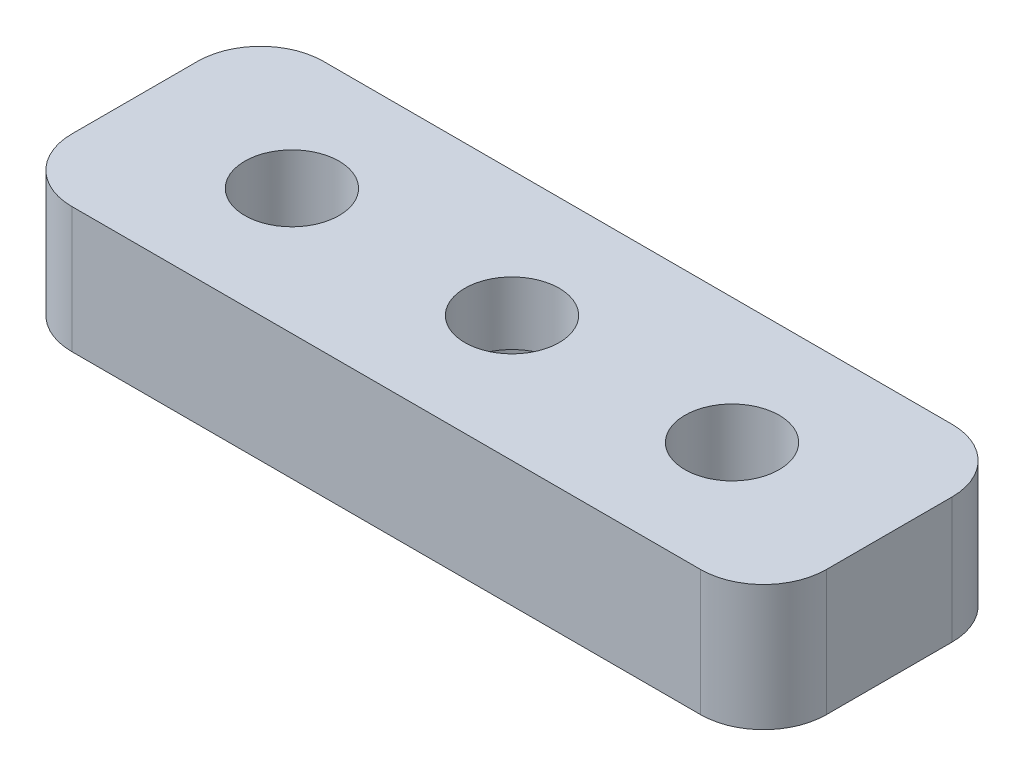
ISO-10303-21;
HEADER;
FILE_DESCRIPTION(('STEP AP214'),'2;1');
FILE_NAME('part.step','',(''),(''),'','','');
FILE_SCHEMA(('AUTOMOTIVE_DESIGN { 1 0 10303 214 1 1 1 1 }'));
ENDSEC;
DATA;
#1=APPLICATION_CONTEXT('core data for automotive mechanical design processes');
#2=APPLICATION_PROTOCOL_DEFINITION('international standard','automotive_design',2000,#1);
#3=PRODUCT_CONTEXT('',#1,'mechanical');
#4=PRODUCT('Part','Part','',(#3));
#5=PRODUCT_RELATED_PRODUCT_CATEGORY('part','',(#4));
#6=PRODUCT_DEFINITION_FORMATION('','',#4);
#7=PRODUCT_DEFINITION_CONTEXT('part definition',#1,'design');
#8=PRODUCT_DEFINITION('design','',#6,#7);
#9=PRODUCT_DEFINITION_SHAPE('','',#8);
#10=(LENGTH_UNIT() NAMED_UNIT(*) SI_UNIT(.MILLI.,.METRE.));
#11=(NAMED_UNIT(*) PLANE_ANGLE_UNIT() SI_UNIT($,.RADIAN.));
#12=(NAMED_UNIT(*) SI_UNIT($,.STERADIAN.) SOLID_ANGLE_UNIT());
#13=UNCERTAINTY_MEASURE_WITH_UNIT(LENGTH_MEASURE(1.E-05),#10,'distance_accuracy_value','');
#14=(GEOMETRIC_REPRESENTATION_CONTEXT(3) GLOBAL_UNCERTAINTY_ASSIGNED_CONTEXT((#13)) GLOBAL_UNIT_ASSIGNED_CONTEXT((#10,
#11,#12)) REPRESENTATION_CONTEXT('',''));
#15=CARTESIAN_POINT('',(0.,0.,0.));
#16=DIRECTION('',(0.,0.,1.));
#17=DIRECTION('',(1.,0.,0.));
#18=AXIS2_PLACEMENT_3D('',#15,#16,#17);
#19=CARTESIAN_POINT('',(-10.,4.,2.));
#20=DIRECTION('',(0.,-1.,0.));
#21=DIRECTION('',(0.,0.,-1.));
#22=AXIS2_PLACEMENT_3D('',#19,#20,#21);
#23=PLANE('',#22);
#24=DIRECTION('',(-1.,0.,0.));
#25=VECTOR('',#24,1.);
#26=CARTESIAN_POINT('',(10.,4.,4.));
#27=LINE('',#26,#25);
#28=CARTESIAN_POINT('',(10.,4.,4.));
#29=VERTEX_POINT('',#28);
#30=CARTESIAN_POINT('',(-10.,4.,4.));
#31=VERTEX_POINT('',#30);
#32=EDGE_CURVE('E88',#29,#31,#27,.T.);
#33=ORIENTED_EDGE('',*,*,#32,.F.);
#34=CARTESIAN_POINT('',(10.,4.,2.));
#35=DIRECTION('',(0.,1.,0.));
#36=DIRECTION('',(0.,0.,1.));
#37=AXIS2_PLACEMENT_3D('',#34,#35,#36);
#38=CIRCLE('',#37,2.);
#39=CARTESIAN_POINT('',(12.,4.,2.));
#40=VERTEX_POINT('',#39);
#41=EDGE_CURVE('E123',#29,#40,#38,.T.);
#42=ORIENTED_EDGE('',*,*,#41,.T.);
#43=DIRECTION('',(0.,0.,1.));
#44=VECTOR('',#43,1.);
#45=CARTESIAN_POINT('',(12.,4.,-2.));
#46=LINE('',#45,#44);
#47=CARTESIAN_POINT('',(12.,4.,-2.));
#48=VERTEX_POINT('',#47);
#49=EDGE_CURVE('E106',#48,#40,#46,.T.);
#50=ORIENTED_EDGE('',*,*,#49,.F.);
#51=CARTESIAN_POINT('',(10.,4.,-2.));
#52=DIRECTION('',(0.,1.,0.));
#53=DIRECTION('',(0.,0.,1.));
#54=AXIS2_PLACEMENT_3D('',#51,#52,#53);
#55=CIRCLE('',#54,2.);
#56=CARTESIAN_POINT('',(10.,4.,-4.));
#57=VERTEX_POINT('',#56);
#58=EDGE_CURVE('E116',#48,#57,#55,.T.);
#59=ORIENTED_EDGE('',*,*,#58,.T.);
#60=DIRECTION('',(1.,0.,0.));
#61=VECTOR('',#60,1.);
#62=CARTESIAN_POINT('',(-10.,4.,-4.));
#63=LINE('',#62,#61);
#64=CARTESIAN_POINT('',(-10.,4.,-4.));
#65=VERTEX_POINT('',#64);
#66=EDGE_CURVE('E120',#65,#57,#63,.T.);
#67=ORIENTED_EDGE('',*,*,#66,.F.);
#68=CARTESIAN_POINT('',(-10.,4.,-2.));
#69=DIRECTION('',(0.,1.,0.));
#70=DIRECTION('',(0.,0.,1.));
#71=AXIS2_PLACEMENT_3D('',#68,#69,#70);
#72=CIRCLE('',#71,2.);
#73=CARTESIAN_POINT('',(-12.,4.,-2.));
#74=VERTEX_POINT('',#73);
#75=EDGE_CURVE('E178',#65,#74,#72,.T.);
#76=ORIENTED_EDGE('',*,*,#75,.T.);
#77=DIRECTION('',(0.,0.,-1.));
#78=VECTOR('',#77,1.);
#79=CARTESIAN_POINT('',(-12.,4.,2.));
#80=LINE('',#79,#78);
#81=CARTESIAN_POINT('',(-12.,4.,2.));
#82=VERTEX_POINT('',#81);
#83=EDGE_CURVE('E171',#82,#74,#80,.T.);
#84=ORIENTED_EDGE('',*,*,#83,.F.);
#85=CARTESIAN_POINT('',(-10.,4.,2.));
#86=DIRECTION('',(0.,-1.,0.));
#87=DIRECTION('',(0.,0.,-1.));
#88=AXIS2_PLACEMENT_3D('',#85,#86,#87);
#89=CIRCLE('',#88,2.);
#90=EDGE_CURVE('E169',#31,#82,#89,.T.);
#91=ORIENTED_EDGE('',*,*,#90,.F.);
#92=EDGE_LOOP('',(#33,#42,#50,#59,#67,#76,#84,#91));
#93=FACE_BOUND('',#92,.T.);
#94=CARTESIAN_POINT('',(0.,4.,0.));
#95=DIRECTION('',(0.,-1.,0.));
#96=DIRECTION('',(0.,0.,-1.));
#97=AXIS2_PLACEMENT_3D('',#94,#95,#96);
#98=CIRCLE('',#97,1.5);
#99=CARTESIAN_POINT('',(0.,4.,-1.5));
#100=VERTEX_POINT('',#99);
#101=EDGE_CURVE('E131',#100,#100,#98,.T.);
#102=ORIENTED_EDGE('',*,*,#101,.T.);
#103=EDGE_LOOP('',(#102));
#104=FACE_BOUND('',#103,.T.);
#105=CARTESIAN_POINT('',(-7.,4.,0.));
#106=DIRECTION('',(0.,-1.,0.));
#107=DIRECTION('',(0.,0.,-1.));
#108=AXIS2_PLACEMENT_3D('',#105,#106,#107);
#109=CIRCLE('',#108,1.5);
#110=CARTESIAN_POINT('',(-7.,4.,-1.5));
#111=VERTEX_POINT('',#110);
#112=EDGE_CURVE('E312',#111,#111,#109,.T.);
#113=ORIENTED_EDGE('',*,*,#112,.T.);
#114=EDGE_LOOP('',(#113));
#115=FACE_BOUND('',#114,.T.);
#116=CARTESIAN_POINT('',(7.,4.,0.));
#117=DIRECTION('',(0.,-1.,0.));
#118=DIRECTION('',(0.,0.,-1.));
#119=AXIS2_PLACEMENT_3D('',#116,#117,#118);
#120=CIRCLE('',#119,1.5);
#121=CARTESIAN_POINT('',(7.,4.,-1.5));
#122=VERTEX_POINT('',#121);
#123=EDGE_CURVE('E308',#122,#122,#120,.F.);
#124=ORIENTED_EDGE('',*,*,#123,.F.);
#125=EDGE_LOOP('',(#124));
#126=FACE_BOUND('',#125,.T.);
#127=ADVANCED_FACE('F34',(#93,#104,#115,#126),#23,.F.);
#128=CARTESIAN_POINT('',(-10.,0.,2.));
#129=DIRECTION('',(0.,-1.,0.));
#130=DIRECTION('',(0.,0.,-1.));
#131=AXIS2_PLACEMENT_3D('',#128,#129,#130);
#132=PLANE('',#131);
#133=CARTESIAN_POINT('',(0.,0.,0.));
#134=DIRECTION('',(0.,1.,0.));
#135=DIRECTION('',(0.,0.,1.));
#136=AXIS2_PLACEMENT_3D('',#133,#134,#135);
#137=CIRCLE('',#136,2.5);
#138=CARTESIAN_POINT('',(0.,0.,2.5));
#139=VERTEX_POINT('',#138);
#140=EDGE_CURVE('E306',#139,#139,#137,.T.);
#141=ORIENTED_EDGE('',*,*,#140,.T.);
#142=EDGE_LOOP('',(#141));
#143=FACE_BOUND('',#142,.T.);
#144=CARTESIAN_POINT('',(-7.,0.,0.));
#145=DIRECTION('',(0.,1.,0.));
#146=DIRECTION('',(0.,0.,1.));
#147=AXIS2_PLACEMENT_3D('',#144,#145,#146);
#148=CIRCLE('',#147,1.5);
#149=CARTESIAN_POINT('',(-7.,0.,1.5));
#150=VERTEX_POINT('',#149);
#151=EDGE_CURVE('E315',#150,#150,#148,.T.);
#152=ORIENTED_EDGE('',*,*,#151,.T.);
#153=EDGE_LOOP('',(#152));
#154=FACE_BOUND('',#153,.T.);
#155=CARTESIAN_POINT('',(10.,0.,2.));
#156=DIRECTION('',(0.,1.,0.));
#157=DIRECTION('',(0.,0.,1.));
#158=AXIS2_PLACEMENT_3D('',#155,#156,#157);
#159=CIRCLE('',#158,2.);
#160=CARTESIAN_POINT('',(10.,0.,4.));
#161=VERTEX_POINT('',#160);
#162=CARTESIAN_POINT('',(12.,0.,2.));
#163=VERTEX_POINT('',#162);
#164=EDGE_CURVE('E146',#161,#163,#159,.T.);
#165=ORIENTED_EDGE('',*,*,#164,.F.);
#166=DIRECTION('',(-1.,0.,0.));
#167=VECTOR('',#166,1.);
#168=CARTESIAN_POINT('',(0.,0.,4.));
#169=LINE('',#168,#167);
#170=CARTESIAN_POINT('',(-10.,0.,4.));
#171=VERTEX_POINT('',#170);
#172=EDGE_CURVE('E84',#161,#171,#169,.T.);
#173=ORIENTED_EDGE('',*,*,#172,.T.);
#174=CARTESIAN_POINT('',(-10.,0.,2.));
#175=DIRECTION('',(0.,-1.,0.));
#176=DIRECTION('',(0.,0.,-1.));
#177=AXIS2_PLACEMENT_3D('',#174,#175,#176);
#178=CIRCLE('',#177,2.);
#179=CARTESIAN_POINT('',(-12.,0.,2.));
#180=VERTEX_POINT('',#179);
#181=EDGE_CURVE('E130',#171,#180,#178,.T.);
#182=ORIENTED_EDGE('',*,*,#181,.T.);
#183=DIRECTION('',(0.,0.,-1.));
#184=VECTOR('',#183,1.);
#185=CARTESIAN_POINT('',(-12.,0.,2.));
#186=LINE('',#185,#184);
#187=CARTESIAN_POINT('',(-12.,0.,-2.));
#188=VERTEX_POINT('',#187);
#189=EDGE_CURVE('E134',#180,#188,#186,.T.);
#190=ORIENTED_EDGE('',*,*,#189,.T.);
#191=CARTESIAN_POINT('',(-10.,0.,-2.));
#192=DIRECTION('',(0.,1.,0.));
#193=DIRECTION('',(0.,0.,1.));
#194=AXIS2_PLACEMENT_3D('',#191,#192,#193);
#195=CIRCLE('',#194,2.);
#196=CARTESIAN_POINT('',(-10.,0.,-4.));
#197=VERTEX_POINT('',#196);
#198=EDGE_CURVE('E137',#197,#188,#195,.T.);
#199=ORIENTED_EDGE('',*,*,#198,.F.);
#200=DIRECTION('',(1.,0.,0.));
#201=VECTOR('',#200,1.);
#202=CARTESIAN_POINT('',(0.,0.,-4.));
#203=LINE('',#202,#201);
#204=CARTESIAN_POINT('',(10.,0.,-4.));
#205=VERTEX_POINT('',#204);
#206=EDGE_CURVE('E140',#197,#205,#203,.T.);
#207=ORIENTED_EDGE('',*,*,#206,.T.);
#208=CARTESIAN_POINT('',(10.,0.,-2.));
#209=DIRECTION('',(0.,1.,0.));
#210=DIRECTION('',(0.,0.,1.));
#211=AXIS2_PLACEMENT_3D('',#208,#209,#210);
#212=CIRCLE('',#211,2.);
#213=CARTESIAN_POINT('',(12.,0.,-2.));
#214=VERTEX_POINT('',#213);
#215=EDGE_CURVE('E143',#214,#205,#212,.T.);
#216=ORIENTED_EDGE('',*,*,#215,.F.);
#217=DIRECTION('',(0.,0.,1.));
#218=VECTOR('',#217,1.);
#219=CARTESIAN_POINT('',(12.,0.,-2.));
#220=LINE('',#219,#218);
#221=EDGE_CURVE('E108',#214,#163,#220,.T.);
#222=ORIENTED_EDGE('',*,*,#221,.T.);
#223=EDGE_LOOP('',(#165,#173,#182,#190,#199,#207,#216,#222));
#224=FACE_BOUND('',#223,.T.);
#225=CARTESIAN_POINT('',(7.,0.,0.));
#226=DIRECTION('',(0.,-1.,0.));
#227=DIRECTION('',(0.,0.,-1.));
#228=AXIS2_PLACEMENT_3D('',#225,#226,#227);
#229=CIRCLE('',#228,1.5);
#230=CARTESIAN_POINT('',(7.,0.,-1.5));
#231=VERTEX_POINT('',#230);
#232=EDGE_CURVE('E318',#231,#231,#229,.T.);
#233=ORIENTED_EDGE('',*,*,#232,.F.);
#234=EDGE_LOOP('',(#233));
#235=FACE_BOUND('',#234,.T.);
#236=ADVANCED_FACE('F164',(#143,#154,#224,#235),#132,.T.);
#237=CARTESIAN_POINT('',(10.,4.,2.));
#238=DIRECTION('',(0.,-1.,0.));
#239=DIRECTION('',(0.,0.,-1.));
#240=AXIS2_PLACEMENT_3D('',#237,#238,#239);
#241=CYLINDRICAL_SURFACE('',#240,2.);
#242=ORIENTED_EDGE('',*,*,#164,.T.);
#243=DIRECTION('',(0.,-1.,0.));
#244=VECTOR('',#243,1.);
#245=CARTESIAN_POINT('',(12.,4.,2.));
#246=LINE('',#245,#244);
#247=EDGE_CURVE('E44',#40,#163,#246,.T.);
#248=ORIENTED_EDGE('',*,*,#247,.F.);
#249=ORIENTED_EDGE('',*,*,#41,.F.);
#250=DIRECTION('',(0.,-1.,0.));
#251=VECTOR('',#250,1.);
#252=CARTESIAN_POINT('',(10.,4.,4.));
#253=LINE('',#252,#251);
#254=EDGE_CURVE('E11',#29,#161,#253,.T.);
#255=ORIENTED_EDGE('',*,*,#254,.T.);
#256=EDGE_LOOP('',(#242,#248,#249,#255));
#257=FACE_BOUND('',#256,.T.);
#258=ADVANCED_FACE('F167',(#257),#241,.T.);
#259=CARTESIAN_POINT('',(12.,4.,-2.));
#260=DIRECTION('',(1.,0.,0.));
#261=DIRECTION('',(0.,0.,-1.));
#262=AXIS2_PLACEMENT_3D('',#259,#260,#261);
#263=PLANE('',#262);
#264=ORIENTED_EDGE('',*,*,#221,.F.);
#265=DIRECTION('',(0.,-1.,0.));
#266=VECTOR('',#265,1.);
#267=CARTESIAN_POINT('',(12.,4.,-2.));
#268=LINE('',#267,#266);
#269=EDGE_CURVE('E102',#48,#214,#268,.T.);
#270=ORIENTED_EDGE('',*,*,#269,.F.);
#271=ORIENTED_EDGE('',*,*,#49,.T.);
#272=ORIENTED_EDGE('',*,*,#247,.T.);
#273=EDGE_LOOP('',(#264,#270,#271,#272));
#274=FACE_BOUND('',#273,.T.);
#275=ADVANCED_FACE('F104',(#274),#263,.T.);
#276=CARTESIAN_POINT('',(10.,4.,-2.));
#277=DIRECTION('',(0.,-1.,0.));
#278=DIRECTION('',(0.,0.,-1.));
#279=AXIS2_PLACEMENT_3D('',#276,#277,#278);
#280=CYLINDRICAL_SURFACE('',#279,2.);
#281=ORIENTED_EDGE('',*,*,#215,.T.);
#282=DIRECTION('',(0.,-1.,0.));
#283=VECTOR('',#282,1.);
#284=CARTESIAN_POINT('',(10.,4.,-4.));
#285=LINE('',#284,#283);
#286=EDGE_CURVE('E112',#57,#205,#285,.T.);
#287=ORIENTED_EDGE('',*,*,#286,.F.);
#288=ORIENTED_EDGE('',*,*,#58,.F.);
#289=ORIENTED_EDGE('',*,*,#269,.T.);
#290=EDGE_LOOP('',(#281,#287,#288,#289));
#291=FACE_BOUND('',#290,.T.);
#292=ADVANCED_FACE('F117',(#291),#280,.T.);
#293=CARTESIAN_POINT('',(0.,4.,-4.));
#294=DIRECTION('',(0.,0.,-1.));
#295=DIRECTION('',(-1.,0.,0.));
#296=AXIS2_PLACEMENT_3D('',#293,#294,#295);
#297=PLANE('',#296);
#298=ORIENTED_EDGE('',*,*,#206,.F.);
#299=DIRECTION('',(0.,-1.,0.));
#300=VECTOR('',#299,1.);
#301=CARTESIAN_POINT('',(-10.,4.,-4.));
#302=LINE('',#301,#300);
#303=EDGE_CURVE('E150',#65,#197,#302,.T.);
#304=ORIENTED_EDGE('',*,*,#303,.F.);
#305=ORIENTED_EDGE('',*,*,#66,.T.);
#306=ORIENTED_EDGE('',*,*,#286,.T.);
#307=EDGE_LOOP('',(#298,#304,#305,#306));
#308=FACE_BOUND('',#307,.T.);
#309=ADVANCED_FACE('F180',(#308),#297,.T.);
#310=CARTESIAN_POINT('',(-10.,4.,-2.));
#311=DIRECTION('',(0.,-1.,0.));
#312=DIRECTION('',(0.,0.,-1.));
#313=AXIS2_PLACEMENT_3D('',#310,#311,#312);
#314=CYLINDRICAL_SURFACE('',#313,2.);
#315=ORIENTED_EDGE('',*,*,#198,.T.);
#316=DIRECTION('',(0.,-1.,0.));
#317=VECTOR('',#316,1.);
#318=CARTESIAN_POINT('',(-12.,4.,-2.));
#319=LINE('',#318,#317);
#320=EDGE_CURVE('E153',#74,#188,#319,.T.);
#321=ORIENTED_EDGE('',*,*,#320,.F.);
#322=ORIENTED_EDGE('',*,*,#75,.F.);
#323=ORIENTED_EDGE('',*,*,#303,.T.);
#324=EDGE_LOOP('',(#315,#321,#322,#323));
#325=FACE_BOUND('',#324,.T.);
#326=ADVANCED_FACE('F184',(#325),#314,.T.);
#327=CARTESIAN_POINT('',(-12.,4.,2.));
#328=DIRECTION('',(-1.,0.,0.));
#329=DIRECTION('',(0.,0.,1.));
#330=AXIS2_PLACEMENT_3D('',#327,#328,#329);
#331=PLANE('',#330);
#332=ORIENTED_EDGE('',*,*,#189,.F.);
#333=DIRECTION('',(0.,-1.,0.));
#334=VECTOR('',#333,1.);
#335=CARTESIAN_POINT('',(-12.,4.,2.));
#336=LINE('',#335,#334);
#337=EDGE_CURVE('E155',#82,#180,#336,.T.);
#338=ORIENTED_EDGE('',*,*,#337,.F.);
#339=ORIENTED_EDGE('',*,*,#83,.T.);
#340=ORIENTED_EDGE('',*,*,#320,.T.);
#341=EDGE_LOOP('',(#332,#338,#339,#340));
#342=FACE_BOUND('',#341,.T.);
#343=ADVANCED_FACE('F187',(#342),#331,.T.);
#344=CARTESIAN_POINT('',(-10.,4.,2.));
#345=DIRECTION('',(0.,-1.,0.));
#346=DIRECTION('',(0.,0.,-1.));
#347=AXIS2_PLACEMENT_3D('',#344,#345,#346);
#348=CYLINDRICAL_SURFACE('',#347,2.);
#349=ORIENTED_EDGE('',*,*,#181,.F.);
#350=DIRECTION('',(0.,-1.,0.));
#351=VECTOR('',#350,1.);
#352=CARTESIAN_POINT('',(-10.,4.,4.));
#353=LINE('',#352,#351);
#354=EDGE_CURVE('E125',#31,#171,#353,.T.);
#355=ORIENTED_EDGE('',*,*,#354,.F.);
#356=ORIENTED_EDGE('',*,*,#90,.T.);
#357=ORIENTED_EDGE('',*,*,#337,.T.);
#358=EDGE_LOOP('',(#349,#355,#356,#357));
#359=FACE_BOUND('',#358,.T.);
#360=ADVANCED_FACE('F160',(#359),#348,.T.);
#361=CARTESIAN_POINT('',(0.,4.,4.));
#362=DIRECTION('',(0.,0.,1.));
#363=DIRECTION('',(1.,0.,0.));
#364=AXIS2_PLACEMENT_3D('',#361,#362,#363);
#365=PLANE('',#364);
#366=ORIENTED_EDGE('',*,*,#172,.F.);
#367=ORIENTED_EDGE('',*,*,#254,.F.);
#368=ORIENTED_EDGE('',*,*,#32,.T.);
#369=ORIENTED_EDGE('',*,*,#354,.T.);
#370=EDGE_LOOP('',(#366,#367,#368,#369));
#371=FACE_BOUND('',#370,.T.);
#372=ADVANCED_FACE('F36',(#371),#365,.T.);
#373=CARTESIAN_POINT('',(0.,4.001,0.));
#374=DIRECTION('',(0.,-1.,0.));
#375=DIRECTION('',(0.,0.,-1.));
#376=AXIS2_PLACEMENT_3D('',#373,#374,#375);
#377=CYLINDRICAL_SURFACE('',#376,1.5);
#378=CARTESIAN_POINT('',(0.,2.,0.));
#379=DIRECTION('',(0.,1.,0.));
#380=DIRECTION('',(0.,0.,1.));
#381=AXIS2_PLACEMENT_3D('',#378,#379,#380);
#382=CIRCLE('',#381,1.5);
#383=CARTESIAN_POINT('',(0.,2.,1.5));
#384=VERTEX_POINT('',#383);
#385=EDGE_CURVE('E38',#384,#384,#382,.T.);
#386=ORIENTED_EDGE('',*,*,#385,.F.);
#387=EDGE_LOOP('',(#386));
#388=FACE_BOUND('',#387,.T.);
#389=ORIENTED_EDGE('',*,*,#101,.F.);
#390=EDGE_LOOP('',(#389));
#391=FACE_BOUND('',#390,.T.);
#392=ADVANCED_FACE('F203',(#388,#391),#377,.F.);
#393=CARTESIAN_POINT('',(-7.,4.001,0.));
#394=DIRECTION('',(0.,-1.,0.));
#395=DIRECTION('',(0.,0.,-1.));
#396=AXIS2_PLACEMENT_3D('',#393,#394,#395);
#397=CYLINDRICAL_SURFACE('',#396,1.5);
#398=ORIENTED_EDGE('',*,*,#151,.F.);
#399=EDGE_LOOP('',(#398));
#400=FACE_BOUND('',#399,.T.);
#401=ORIENTED_EDGE('',*,*,#112,.F.);
#402=EDGE_LOOP('',(#401));
#403=FACE_BOUND('',#402,.T.);
#404=ADVANCED_FACE('F251',(#400,#403),#397,.F.);
#405=CARTESIAN_POINT('',(7.,4.001,0.));
#406=DIRECTION('',(0.,-1.,0.));
#407=DIRECTION('',(0.,0.,-1.));
#408=AXIS2_PLACEMENT_3D('',#405,#406,#407);
#409=CYLINDRICAL_SURFACE('',#408,1.5);
#410=ORIENTED_EDGE('',*,*,#232,.T.);
#411=EDGE_LOOP('',(#410));
#412=FACE_BOUND('',#411,.T.);
#413=ORIENTED_EDGE('',*,*,#123,.T.);
#414=EDGE_LOOP('',(#413));
#415=FACE_BOUND('',#414,.T.);
#416=ADVANCED_FACE('F256',(#412,#415),#409,.F.);
#417=CARTESIAN_POINT('',(0.,2.,0.));
#418=DIRECTION('',(0.,-1.,0.));
#419=DIRECTION('',(0.,0.,-1.));
#420=AXIS2_PLACEMENT_3D('',#417,#418,#419);
#421=CYLINDRICAL_SURFACE('',#420,2.5);
#422=CARTESIAN_POINT('',(0.,2.,0.));
#423=DIRECTION('',(0.,1.,0.));
#424=DIRECTION('',(0.,0.,1.));
#425=AXIS2_PLACEMENT_3D('',#422,#423,#424);
#426=CIRCLE('',#425,2.5);
#427=CARTESIAN_POINT('',(0.,2.,2.5));
#428=VERTEX_POINT('',#427);
#429=EDGE_CURVE('E305',#428,#428,#426,.T.);
#430=ORIENTED_EDGE('',*,*,#429,.T.);
#431=EDGE_LOOP('',(#430));
#432=FACE_BOUND('',#431,.T.);
#433=ORIENTED_EDGE('',*,*,#140,.F.);
#434=EDGE_LOOP('',(#433));
#435=FACE_BOUND('',#434,.T.);
#436=ADVANCED_FACE('F266',(#432,#435),#421,.F.);
#437=CARTESIAN_POINT('',(0.,2.,0.));
#438=DIRECTION('',(0.,1.,0.));
#439=DIRECTION('',(0.,0.,1.));
#440=AXIS2_PLACEMENT_3D('',#437,#438,#439);
#441=PLANE('',#440);
#442=ORIENTED_EDGE('',*,*,#385,.T.);
#443=EDGE_LOOP('',(#442));
#444=FACE_BOUND('',#443,.T.);
#445=ORIENTED_EDGE('',*,*,#429,.F.);
#446=EDGE_LOOP('',(#445));
#447=FACE_BOUND('',#446,.T.);
#448=ADVANCED_FACE('F286',(#444,#447),#441,.F.);
#449=CLOSED_SHELL('',(#127,#236,#258,#275,#292,#309,#326,#343,#360,#372,#392,#404,#416,#436,#448));
#450=MANIFOLD_SOLID_BREP('B2',#449);
#451=ADVANCED_BREP_SHAPE_REPRESENTATION('',(#18,#450),#14);
#452=SHAPE_DEFINITION_REPRESENTATION(#9,#451);
ENDSEC;
END-ISO-10303-21;
